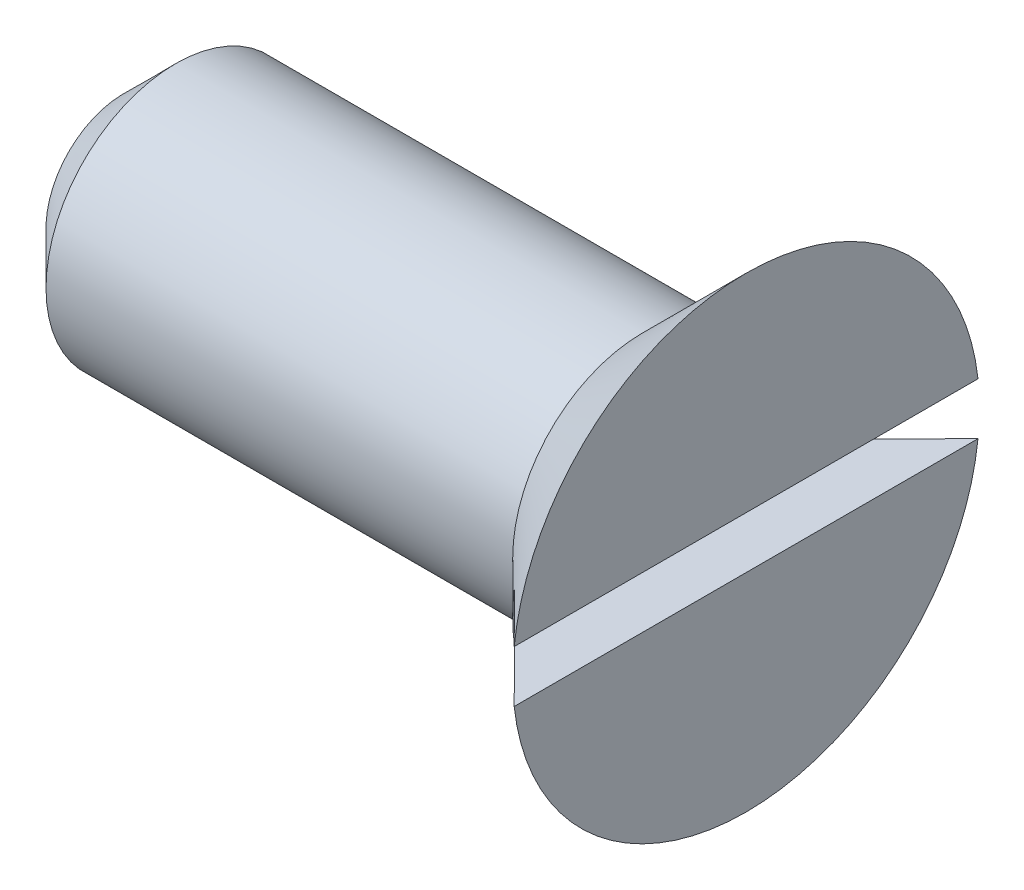
ISO-10303-21;
HEADER;
FILE_DESCRIPTION(('STEP AP214'),'2;1');
FILE_NAME('part.step','',(''),(''),'','','');
FILE_SCHEMA(('AUTOMOTIVE_DESIGN { 1 0 10303 214 1 1 1 1 }'));
ENDSEC;
DATA;
#1=APPLICATION_CONTEXT('core data for automotive mechanical design processes');
#2=APPLICATION_PROTOCOL_DEFINITION('international standard','automotive_design',2000,#1);
#3=PRODUCT_CONTEXT('',#1,'mechanical');
#4=PRODUCT('Part','Part','',(#3));
#5=PRODUCT_RELATED_PRODUCT_CATEGORY('part','',(#4));
#6=PRODUCT_DEFINITION_FORMATION('','',#4);
#7=PRODUCT_DEFINITION_CONTEXT('part definition',#1,'design');
#8=PRODUCT_DEFINITION('design','',#6,#7);
#9=PRODUCT_DEFINITION_SHAPE('','',#8);
#10=(LENGTH_UNIT() NAMED_UNIT(*) SI_UNIT(.MILLI.,.METRE.));
#11=(NAMED_UNIT(*) PLANE_ANGLE_UNIT() SI_UNIT($,.RADIAN.));
#12=(NAMED_UNIT(*) SI_UNIT($,.STERADIAN.) SOLID_ANGLE_UNIT());
#13=UNCERTAINTY_MEASURE_WITH_UNIT(LENGTH_MEASURE(1.E-05),#10,'distance_accuracy_value','');
#14=(GEOMETRIC_REPRESENTATION_CONTEXT(3) GLOBAL_UNCERTAINTY_ASSIGNED_CONTEXT((#13)) GLOBAL_UNIT_ASSIGNED_CONTEXT((#10,
#11,#12)) REPRESENTATION_CONTEXT('',''));
#15=CARTESIAN_POINT('',(0.,0.,0.));
#16=DIRECTION('',(0.,0.,1.));
#17=DIRECTION('',(1.,0.,0.));
#18=AXIS2_PLACEMENT_3D('',#15,#16,#17);
#19=CARTESIAN_POINT('',(12.,-6.38378239159465E-13,-4.5000000000012));
#20=DIRECTION('',(-1.,0.,0.));
#21=DIRECTION('',(0.,0.,1.));
#22=AXIS2_PLACEMENT_3D('',#19,#20,#21);
#23=PLANE('',#22);
#24=CARTESIAN_POINT('',(12.,-6.93889390390723E-13,-1.22124532708767E-12));
#25=DIRECTION('',(-1.,0.,0.));
#26=DIRECTION('',(0.,0.,1.));
#27=AXIS2_PLACEMENT_3D('',#24,#25,#26);
#28=CIRCLE('',#27,4.50000000000001);
#29=CARTESIAN_POINT('',(12.,0.499999999999154,4.47213595499676));
#30=VERTEX_POINT('',#29);
#31=CARTESIAN_POINT('',(12.,0.499999999999445,-4.47213595500109));
#32=VERTEX_POINT('',#31);
#33=EDGE_CURVE('E111',#30,#32,#28,.T.);
#34=ORIENTED_EDGE('',*,*,#33,.F.);
#35=DIRECTION('',(0.,0.,0.999999999999974));
#36=VECTOR('',#35,1.);
#37=CARTESIAN_POINT('',(12.,0.499999999999307,-4.82876236688612));
#38=LINE('',#37,#36);
#39=EDGE_CURVE('E106',#32,#30,#38,.T.);
#40=ORIENTED_EDGE('',*,*,#39,.F.);
#41=EDGE_LOOP('',(#34,#40));
#42=FACE_BOUND('',#41,.T.);
#43=ADVANCED_FACE('F50',(#42),#23,.F.);
#44=CARTESIAN_POINT('',(0.,0.,-2.50000000000072));
#45=DIRECTION('',(1.,0.,0.));
#46=DIRECTION('',(0.,0.,-1.));
#47=AXIS2_PLACEMENT_3D('',#44,#45,#46);
#48=PLANE('',#47);
#49=CARTESIAN_POINT('',(0.,0.,0.));
#50=DIRECTION('',(1.,0.,0.));
#51=DIRECTION('',(0.,0.,-1.));
#52=AXIS2_PLACEMENT_3D('',#49,#50,#51);
#53=CIRCLE('',#52,1.5);
#54=CARTESIAN_POINT('',(0.,0.,-1.5));
#55=VERTEX_POINT('',#54);
#56=EDGE_CURVE('E115',#55,#55,#53,.F.);
#57=ORIENTED_EDGE('',*,*,#56,.T.);
#58=EDGE_LOOP('',(#57));
#59=FACE_BOUND('',#58,.T.);
#60=ADVANCED_FACE('F150',(#59),#48,.F.);
#61=CARTESIAN_POINT('',(12.,-0.500000000000403,-4.47213595500105));
#62=VERTEX_POINT('',#61);
#63=CARTESIAN_POINT('',(12.,-0.50000000000068,4.47213595499722));
#64=VERTEX_POINT('',#63);
#65=EDGE_CURVE('E105',#62,#64,#28,.T.);
#66=ORIENTED_EDGE('',*,*,#65,.F.);
#67=DIRECTION('',(0.,0.,-0.999999999999974));
#68=VECTOR('',#67,1.);
#69=CARTESIAN_POINT('',(12.,-0.500000000000361,-4.82876236688597));
#70=LINE('',#69,#68);
#71=EDGE_CURVE('E97',#64,#62,#70,.T.);
#72=ORIENTED_EDGE('',*,*,#71,.F.);
#73=EDGE_LOOP('',(#66,#72));
#74=FACE_BOUND('',#73,.T.);
#75=ADVANCED_FACE('F104',(#74),#23,.F.);
#76=CARTESIAN_POINT('',(12.,-6.93889390390723E-13,-1.22124532708767E-12));
#77=DIRECTION('',(1.,0.,0.));
#78=DIRECTION('',(0.,0.,-1.));
#79=AXIS2_PLACEMENT_3D('',#76,#77,#78);
#80=CONICAL_SURFACE('',#79,4.50000000000001,0.78539816339745);
#81=CARTESIAN_POINT('',(11.,1.19348975147204E-12,-5.74540415243519E-12));
#82=DIRECTION('',(1.,0.,0.));
#83=DIRECTION('',(0.,0.,-1.));
#84=AXIS2_PLACEMENT_3D('',#81,#82,#83);
#85=CIRCLE('',#84,3.5);
#86=CARTESIAN_POINT('',(11.,0.500000000001374,3.4641016151314));
#87=VERTEX_POINT('',#86);
#88=CARTESIAN_POINT('',(11.,-0.499999999999001,3.46410161513135));
#89=VERTEX_POINT('',#88);
#90=EDGE_CURVE('E76',#87,#89,#85,.T.);
#91=ORIENTED_EDGE('',*,*,#90,.F.);
#92=CARTESIAN_POINT('',(17.4334310828825,0.500000000000722,-9.92083933336727));
#93=CARTESIAN_POINT('',(17.094622836699,0.500000000001105,-9.58159761233316));
#94=CARTESIAN_POINT('',(16.7558333911452,0.500000000001262,-9.24233710479051));
#95=CARTESIAN_POINT('',(16.078313934879,0.500000000001377,-8.56375204602625));
#96=CARTESIAN_POINT('',(15.7395839245957,0.500000000001335,-8.22442749437636));
#97=CARTESIAN_POINT('',(15.0621562101789,0.500000000001304,-7.54563881132056));
#98=CARTESIAN_POINT('',(14.7234585196696,0.500000000001315,-7.20617466631724));
#99=CARTESIAN_POINT('',(14.0461951542393,0.500000000001324,-6.52711926848112));
#100=CARTESIAN_POINT('',(13.7076294784402,0.500000000001321,-6.18752801652417));
#101=CARTESIAN_POINT('',(13.0230688559618,0.500000000001317,-5.50046940668222));
#102=CARTESIAN_POINT('',(12.6770786993064,0.500000000001316,-5.15299727610346));
#103=CARTESIAN_POINT('',(11.9854716695215,0.500000000001322,-4.45766761430393));
#104=CARTESIAN_POINT('',(11.6398548039808,0.500000000001329,-4.1098100755289));
#105=CARTESIAN_POINT('',(11.1220495656091,0.500000000001313,-3.58744392363228));
#106=CARTESIAN_POINT('',(10.9495599143647,0.500000000001303,-3.4132341018551));
#107=CARTESIAN_POINT('',(10.6049016321769,0.500000000001334,-3.06449437078587));
#108=CARTESIAN_POINT('',(10.4327330038494,0.500000000001374,-2.88996445890822));
#109=CARTESIAN_POINT('',(10.0889298219588,0.500000000001263,-2.54039099537063));
#110=CARTESIAN_POINT('',(9.91729524886004,0.500000000001112,-2.3653474629649));
#111=CARTESIAN_POINT('',(9.66060434588069,0.500000000001421,-2.10204221394459));
#112=CARTESIAN_POINT('',(9.57516809923935,0.500000000001614,-2.01415105527254));
#113=CARTESIAN_POINT('',(9.40467044483652,0.500000000001022,-1.83800611142218));
#114=CARTESIAN_POINT('',(9.31960903527704,0.500000000000238,-1.7497523279872));
#115=CARTESIAN_POINT('',(9.18895844071863,0.500000000000685,-1.61330986538524));
#116=CARTESIAN_POINT('',(9.14316496753373,0.500000000001156,-1.5653168931215));
#117=CARTESIAN_POINT('',(9.05179993978355,0.50000000000148,-1.46911892921733));
#118=CARTESIAN_POINT('',(9.00622838799009,0.500000000001333,-1.42091393494294));
#119=CARTESIAN_POINT('',(8.91548272610002,0.500000000001303,-1.32433574945523));
#120=CARTESIAN_POINT('',(8.87030795026539,0.50000000000142,-1.27596318514585));
#121=CARTESIAN_POINT('',(8.78036644382885,0.500000000001215,-1.17884327238731));
#122=CARTESIAN_POINT('',(8.73559970075986,0.500000000000893,-1.13009593547346));
#123=CARTESIAN_POINT('',(8.63156798542597,0.500000000000752,-1.01549018413044));
#124=CARTESIAN_POINT('',(8.57252649589879,0.500000000001141,-0.949426917330761));
#125=CARTESIAN_POINT('',(8.48517998291026,0.500000000001407,-0.849027252819726));
#126=CARTESIAN_POINT('',(8.45620834486544,0.500000000001442,-0.815271939591469));
#127=CARTESIAN_POINT('',(8.3988965778735,0.500000000001193,-0.747230628198328));
#128=CARTESIAN_POINT('',(8.37055641002422,0.50000000000091,-0.712944662946387));
#129=CARTESIAN_POINT('',(8.31453294463235,0.500000000000923,-0.6433466709596));
#130=CARTESIAN_POINT('',(8.28685743704845,0.500000000001225,-0.608028338858887));
#131=CARTESIAN_POINT('',(8.23288658906871,0.50000000000141,-0.536358792810566));
#132=CARTESIAN_POINT('',(8.20659077183528,0.500000000001292,-0.500007942498352));
#133=CARTESIAN_POINT('',(8.15629156070385,0.500000000001343,-0.425977065402346));
#134=CARTESIAN_POINT('',(8.13227821986974,0.500000000001511,-0.388303888131977));
#135=CARTESIAN_POINT('',(8.08791744878626,0.500000000001125,-0.310893832367545));
#136=CARTESIAN_POINT('',(8.06756045180613,0.500000000000573,-0.271162700484368));
#137=CARTESIAN_POINT('',(8.03752958522089,0.500000000000834,-0.199280580632974));
#138=CARTESIAN_POINT('',(8.02645653543489,0.500000000001338,-0.167736256207086));
#139=CARTESIAN_POINT('',(8.00963250807975,0.500000000001297,-0.103336815945441));
#140=CARTESIAN_POINT('',(8.00385536010017,0.500000000000757,-0.0704889918050561));
#141=CARTESIAN_POINT('',(7.99890901284613,0.50000000000077,-0.00391759075869643));
#142=CARTESIAN_POINT('',(7.99980881923559,0.500000000001334,0.0298115312882031));
#143=CARTESIAN_POINT('',(8.00813776796226,0.5000000000013,0.0965071541604435));
#144=CARTESIAN_POINT('',(8.01558887477218,0.500000000000698,0.129470706320155));
#145=CARTESIAN_POINT('',(8.03280310431992,0.500000000000788,0.185466604171374));
#146=CARTESIAN_POINT('',(8.04146820312156,0.500000000001186,0.208860616958532));
#147=CARTESIAN_POINT('',(8.06080064801388,0.500000000001449,0.254816663178605));
#148=CARTESIAN_POINT('',(8.07146948011995,0.500000000001315,0.2773780641728));
#149=CARTESIAN_POINT('',(8.09431898535568,0.50000000000132,0.321840394641634));
#150=CARTESIAN_POINT('',(8.10650643866166,0.500000000001461,0.343737776911768));
#151=CARTESIAN_POINT('',(8.1319600328398,0.500000000001174,0.386877858465585));
#152=CARTESIAN_POINT('',(8.14522573137379,0.500000000000746,0.408120821334638));
#153=CARTESIAN_POINT('',(8.19135616707382,0.500000000000103,0.478982606500176));
#154=CARTESIAN_POINT('',(8.22605662646354,0.500000000000992,0.527397940679881));
#155=CARTESIAN_POINT('',(8.29781340694147,0.500000000001643,0.622462852281961));
#156=CARTESIAN_POINT('',(8.33487192774693,0.500000000001405,0.669110714246478));
#157=CARTESIAN_POINT('',(8.41048560367556,0.500000000001229,0.761369243957627));
#158=CARTESIAN_POINT('',(8.44904426520622,0.500000000001292,0.806977030620386));
#159=CARTESIAN_POINT('',(8.52703681580845,0.500000000001342,0.897398644487044));
#160=CARTESIAN_POINT('',(8.56647033422307,0.50000000000133,0.942212793993296));
#161=CARTESIAN_POINT('',(8.64602665873576,0.500000000001304,1.03139885551162));
#162=CARTESIAN_POINT('',(8.6861507758829,0.50000000000129,1.07576959563431));
#163=CARTESIAN_POINT('',(8.76683137244409,0.500000000001345,1.16412357585452));
#164=CARTESIAN_POINT('',(8.80738789577994,0.500000000001415,1.2081067757426));
#165=CARTESIAN_POINT('',(8.92939021280496,0.500000000001122,1.33948593316749));
#166=CARTESIAN_POINT('',(9.0112969194605,0.500000000000259,1.42645342036056));
#167=CARTESIAN_POINT('',(9.17505616742924,0.500000000000213,1.59891371342962));
#168=CARTESIAN_POINT('',(9.25690220849735,0.500000000001015,1.68441271958131));
#169=CARTESIAN_POINT('',(9.42104405611289,0.500000000001619,1.8549782909493));
#170=CARTESIAN_POINT('',(9.50333986439926,0.500000000001422,1.94004485449117));
#171=CARTESIAN_POINT('',(9.75067700604964,0.500000000001106,2.19481879501315));
#172=CARTESIAN_POINT('',(9.91616244228635,0.500000000001261,2.36409455787665));
#173=CARTESIAN_POINT('',(10.2478424695637,0.500000000001372,2.70216112923317));
#174=CARTESIAN_POINT('',(10.4140374466611,0.500000000001328,2.8709515580475));
#175=CARTESIAN_POINT('',(10.7467865073139,0.500000000001305,3.20817270388613));
#176=CARTESIAN_POINT('',(10.9133405850914,0.500000000001327,3.37660342661256));
#177=CARTESIAN_POINT('',(11.2461450940172,0.500000000001307,3.71270085678454));
#178=CARTESIAN_POINT('',(11.412394796293,0.500000000001265,3.88036828639177));
#179=CARTESIAN_POINT('',(11.7450495611567,0.500000000001367,4.21555034245018));
#180=CARTESIAN_POINT('',(11.9114546243984,0.500000000001511,4.38306496825236));
#181=CARTESIAN_POINT('',(12.4107648936833,0.500000000000927,4.88538300082148));
#182=CARTESIAN_POINT('',(12.7438307481285,0.499999999999188,5.22002669562224));
#183=CARTESIAN_POINT('',(13.4391444176929,0.499999999998914,5.91814806333324));
#184=CARTESIAN_POINT('',(13.8014133442417,0.500000000000672,6.28160470104474));
#185=CARTESIAN_POINT('',(14.526139541999,0.50000000000196,7.00837896847507));
#186=CARTESIAN_POINT('',(14.8885968242511,0.500000000001489,7.37169658718066));
#187=CARTESIAN_POINT('',(15.6147555520468,0.500000000001141,8.09937108507071));
#188=CARTESIAN_POINT('',(15.9784573244717,0.500000000001265,8.4637276380171));
#189=CARTESIAN_POINT('',(16.7059094181798,0.500000000001365,9.19234290705398));
#190=CARTESIAN_POINT('',(17.0696597344934,0.500000000001342,9.55660162810588));
#191=CARTESIAN_POINT('',(17.4334310828838,0.500000000000875,9.92083933335545));
#192=B_SPLINE_CURVE_WITH_KNOTS('',3,(#92,#93,#94,#95,#96,#97,#98,#99,#100,#101,#102,#103,#104,
#105,#106,#107,#108,#109,#110,#111,#112,#113,#114,#115,#116,#117,#118,#119,#120,#121,#122,#123,
#124,#125,#126,#127,#128,#129,#130,#131,#132,#133,#134,#135,#136,#137,#138,#139,#140,#141,#142,
#143,#144,#145,#146,#147,#148,#149,#150,#151,#152,#153,#154,#155,#156,#157,#158,#159,#160,#161,
#162,#163,#164,#165,#166,#167,#168,#169,#170,#171,#172,#173,#174,#175,#176,#177,#178,#179,#180,
#181,#182,#183,#184,#185,#186,#187,#188,#189,#190,#191),.UNSPECIFIED.,.F.,.F.,(4,2,2,2,2,2,2,2,
2,2,2,2,2,2,2,2,2,2,2,2,2,2,2,2,2,2,2,2,2,2,2,2,2,2,2,2,2,2,2,2,2,2,2,2,2,2,2,2,2,4),(0.,
1.43836149369475,2.87673297314253,4.31533237234154,5.75392203488066,7.22498096900311,
8.69606926591532,9.43153865323218,10.1670140078269,10.9024621349981,11.2701813429453,
11.6378987851402,11.8369040385567,12.0359117712339,12.2344694542119,12.4330210499636,
12.6988031931186,12.8322483695515,12.965685302143,13.1002750154363,13.2348179022873,
13.3687446332908,13.502315674941,13.6022937476715,13.7017750593242,13.8022859217004,
13.9031350562239,13.977874330053,14.0526692527251,14.1278109554241,14.202921986168,
14.3814550436051,14.5601571590546,14.7393055443459,14.9183794257286,15.0978422373122,
15.2773234549228,15.6357121558031,15.9907874462848,16.345864110577,17.0560417926032,
17.7666739605456,18.4772947785412,19.1856462514791,19.8940007191524,21.3104302706779,
22.8499286738185,24.3895307818776,25.9339763327701,27.4783170755748),.UNSPECIFIED.);
#193=EDGE_CURVE('E13',#87,#30,#192,.T.);
#194=ORIENTED_EDGE('',*,*,#193,.T.);
#195=ORIENTED_EDGE('',*,*,#33,.T.);
#196=CARTESIAN_POINT('',(11.,0.500000000001222,-3.46410161514364));
#197=VERTEX_POINT('',#196);
#198=EDGE_CURVE('E54',#32,#197,#192,.T.);
#199=ORIENTED_EDGE('',*,*,#198,.T.);
#200=CARTESIAN_POINT('',(11.,-0.499999999998973,-3.46410161514328));
#201=VERTEX_POINT('',#200);
#202=EDGE_CURVE('E126',#201,#197,#85,.T.);
#203=ORIENTED_EDGE('',*,*,#202,.F.);
#204=CARTESIAN_POINT('',(17.4334310828852,-0.499999999999112,9.92083933335497));
#205=CARTESIAN_POINT('',(17.0946228366973,-0.499999999998884,9.58159761232457));
#206=CARTESIAN_POINT('',(16.7558333911414,-0.49999999999879,9.24233710478321));
#207=CARTESIAN_POINT('',(16.0783139348732,-0.499999999998721,8.56375204601941));
#208=CARTESIAN_POINT('',(15.7395839245899,-0.499999999998746,8.22442749436869));
#209=CARTESIAN_POINT('',(15.0621562101727,-0.499999999998764,7.54563881131184));
#210=CARTESIAN_POINT('',(14.7234585196629,-0.499999999998757,7.2061746663083));
#211=CARTESIAN_POINT('',(14.0461951542318,-0.499999999998752,6.52711926847161));
#212=CARTESIAN_POINT('',(13.7076294784325,-0.499999999998753,6.18752801651429));
#213=CARTESIAN_POINT('',(13.0230688559536,-0.499999999998756,5.50046940667194));
#214=CARTESIAN_POINT('',(12.6770786992982,-0.499999999998757,5.15299727609313));
#215=CARTESIAN_POINT('',(11.9854716695132,-0.499999999998751,4.45766761429352));
#216=CARTESIAN_POINT('',(11.6398548039723,-0.499999999998745,4.10981007551844));
#217=CARTESIAN_POINT('',(11.1220495656005,-0.499999999998758,3.58744392362172));
#218=CARTESIAN_POINT('',(10.9495599143561,-0.499999999998766,3.4132341018445));
#219=CARTESIAN_POINT('',(10.6049016321681,-0.499999999998741,3.06449437077519));
#220=CARTESIAN_POINT('',(10.4327330038406,-0.499999999998707,2.88996445889752));
#221=CARTESIAN_POINT('',(10.0889298219498,-0.4999999999988,2.54039099535981));
#222=CARTESIAN_POINT('',(9.91729524885107,-0.499999999998927,2.36534746295399));
#223=CARTESIAN_POINT('',(9.6606043458715,-0.499999999998667,2.10204221393371));
#224=CARTESIAN_POINT('',(9.57516809923005,-0.499999999998505,2.01415105526171));
#225=CARTESIAN_POINT('',(9.40467044482735,-0.499999999999002,1.83800611141111));
#226=CARTESIAN_POINT('',(9.31960903526813,-0.499999999999661,1.74975232797583));
#227=CARTESIAN_POINT('',(9.18895844071013,-0.499999999999286,1.6133098653747));
#228=CARTESIAN_POINT('',(9.1431649675257,-0.49999999999889,1.56531689311183));
#229=CARTESIAN_POINT('',(9.05179993977676,-0.499999999998617,1.46911892920911));
#230=CARTESIAN_POINT('',(9.00622838798407,-0.499999999998739,1.42091393493531));
#231=CARTESIAN_POINT('',(8.91548272609509,-0.499999999998767,1.3243357494492));
#232=CARTESIAN_POINT('',(8.87030795026078,-0.499999999998673,1.27596318514082));
#233=CARTESIAN_POINT('',(8.78036644382629,-0.499999999998834,1.17884327238294));
#234=CARTESIAN_POINT('',(8.73559970075905,-0.499999999999089,1.13009593546875));
#235=CARTESIAN_POINT('',(8.63156798542628,-0.499999999999209,1.01549018412609));
#236=CARTESIAN_POINT('',(8.57252649589775,-0.499999999998912,0.949426917327777));
#237=CARTESIAN_POINT('',(8.48517998290814,-0.499999999998673,0.849027252817873));
#238=CARTESIAN_POINT('',(8.45620834486312,-0.499999999998628,0.815271939589846));
#239=CARTESIAN_POINT('',(8.39889657787228,-0.499999999998878,0.747230628195918));
#240=CARTESIAN_POINT('',(8.3705564100243,-0.499999999999172,0.712944662942959));
#241=CARTESIAN_POINT('',(8.31453294463225,-0.499999999999164,0.643346670956281));
#242=CARTESIAN_POINT('',(8.28685743704685,-0.499999999998856,0.608028338856711));
#243=CARTESIAN_POINT('',(8.23288658906609,-0.49999999999865,0.536358792809157));
#244=CARTESIAN_POINT('',(8.20659077183315,-0.499999999998753,0.500007942496565));
#245=CARTESIAN_POINT('',(8.15629156070123,-0.499999999998753,0.425977065400788));
#246=CARTESIAN_POINT('',(8.13227821986614,-0.499999999998651,0.388303888131028));
#247=CARTESIAN_POINT('',(8.08791744878457,-0.499999999998855,0.310893832365695));
#248=CARTESIAN_POINT('',(8.06756045180735,-0.49999999999916,0.271162700480993));
#249=CARTESIAN_POINT('',(8.03752958522003,-0.499999999999004,0.199280580629551));
#250=CARTESIAN_POINT('',(8.02645653543084,-0.499999999998716,0.167736256204517));
#251=CARTESIAN_POINT('',(8.00963250807616,-0.49999999999879,0.103336815943072));
#252=CARTESIAN_POINT('',(8.00385536010019,-0.499999999999149,0.0704889918020385));
#253=CARTESIAN_POINT('',(7.99890901284611,-0.499999999999131,0.00391759075484003));
#254=CARTESIAN_POINT('',(7.99980881923184,-0.499999999998746,-0.0298115312922451));
#255=CARTESIAN_POINT('',(8.00813776795851,-0.499999999998759,-0.0965071541640469));
#256=CARTESIAN_POINT('',(8.01558887477219,-0.499999999999161,-0.129470706323132));
#257=CARTESIAN_POINT('',(8.03280310431993,-0.499999999999101,-0.185466604174954));
#258=CARTESIAN_POINT('',(8.04146820311953,-0.499999999998836,-0.208860616962923));
#259=CARTESIAN_POINT('',(8.06080064801057,-0.499999999998669,-0.25481666318346));
#260=CARTESIAN_POINT('',(8.07146948011738,-0.499999999998768,-0.277378064177315));
#261=CARTESIAN_POINT('',(8.09431898535349,-0.499999999998738,-0.321840394645944));
#262=CARTESIAN_POINT('',(8.10650643865911,-0.499999999998608,-0.343737776916214));
#263=CARTESIAN_POINT('',(8.13196003283805,-0.499999999998897,-0.386877858469546));
#264=CARTESIAN_POINT('',(8.14522573137321,-0.499999999999315,-0.408120821337975));
#265=CARTESIAN_POINT('',(8.19135616707551,-0.499999999999942,-0.478982606503094));
#266=CARTESIAN_POINT('',(8.22605662646368,-0.499999999999072,-0.527397940684685));
#267=CARTESIAN_POINT('',(8.29781340694112,-0.499999999998433,-0.62246285228864));
#268=CARTESIAN_POINT('',(8.33487192774763,-0.499999999998667,-0.669110714253147));
#269=CARTESIAN_POINT('',(8.41048560367748,-0.499999999998839,-0.761369243964572));
#270=CARTESIAN_POINT('',(8.44904426520831,-0.499999999998777,-0.806977030627621));
#271=CARTESIAN_POINT('',(8.52703681581108,-0.499999999998728,-0.897398644494798));
#272=CARTESIAN_POINT('',(8.56647033422608,-0.499999999998743,-0.942212794001278));
#273=CARTESIAN_POINT('',(8.64602665873952,-0.499999999998762,-1.03139885552012));
#274=CARTESIAN_POINT('',(8.68615077588704,-0.499999999998768,-1.0757695956431));
#275=CARTESIAN_POINT('',(8.7668313724489,-0.499999999998736,-1.16412357586395));
#276=CARTESIAN_POINT('',(8.80738789578503,-0.499999999998698,-1.20810677575238));
#277=CARTESIAN_POINT('',(8.92939021281153,-0.49999999999886,-1.33948593317805));
#278=CARTESIAN_POINT('',(9.01129691946871,-0.499999999999336,-1.42645342037112));
#279=CARTESIAN_POINT('',(9.17505616743844,-0.499999999999361,-1.59891371344089));
#280=CARTESIAN_POINT('',(9.2569022085059,-0.499999999998919,-1.68441271959328));
#281=CARTESIAN_POINT('',(9.42104405612105,-0.499999999998586,-1.85497829096181));
#282=CARTESIAN_POINT('',(9.50333986440767,-0.499999999998694,-1.94004485450352));
#283=CARTESIAN_POINT('',(9.75067700605855,-0.499999999998868,-2.19481879502524));
#284=CARTESIAN_POINT('',(9.91616244229524,-0.499999999998783,-2.3640945578889));
#285=CARTESIAN_POINT('',(10.2478424695726,-0.499999999998722,-2.70216112924546));
#286=CARTESIAN_POINT('',(10.41403744667,-0.499999999998746,-2.87095155805967));
#287=CARTESIAN_POINT('',(10.7467865073228,-0.499999999998758,-3.20817270389813));
#288=CARTESIAN_POINT('',(10.9133405851002,-0.499999999998744,-3.37660342662451));
#289=CARTESIAN_POINT('',(11.246145094026,-0.499999999998759,-3.7127008567964));
#290=CARTESIAN_POINT('',(11.4123947963018,-0.499999999998788,-3.8803682864036));
#291=CARTESIAN_POINT('',(11.7450495611655,-0.499999999998715,-4.21555034246197));
#292=CARTESIAN_POINT('',(11.9114546244072,-0.499999999998613,-4.38306496826412));
#293=CARTESIAN_POINT('',(12.4107648936922,-0.499999999999029,-4.88538300083323));
#294=CARTESIAN_POINT('',(12.7438307481375,-0.500000000000269,-5.22002669563397));
#295=CARTESIAN_POINT('',(13.4391444177016,-0.500000000000462,-5.91814806334457));
#296=CARTESIAN_POINT('',(13.80141334425,-0.499999999999207,-6.2816047010557));
#297=CARTESIAN_POINT('',(14.5261395420063,-0.499999999998294,-7.0083789684853));
#298=CARTESIAN_POINT('',(14.888596824258,-0.499999999998636,-7.37169658719054));
#299=CARTESIAN_POINT('',(15.6147555520531,-0.499999999998866,-8.09937108507948));
#300=CARTESIAN_POINT('',(15.978457324478,-0.499999999998752,-8.46372763802512));
#301=CARTESIAN_POINT('',(16.7059094181844,-0.499999999998748,-9.19234290706213));
#302=CARTESIAN_POINT('',(17.0696597344963,-0.499999999998857,-9.55660162811493));
#303=CARTESIAN_POINT('',(17.4334310828832,-0.499999999999418,-9.92083933336722));
#304=B_SPLINE_CURVE_WITH_KNOTS('',3,(#204,#205,#206,#207,#208,#209,#210,#211,#212,#213,#214,
#215,#216,#217,#218,#219,#220,#221,#222,#223,#224,#225,#226,#227,#228,#229,#230,#231,#232,#233,
#234,#235,#236,#237,#238,#239,#240,#241,#242,#243,#244,#245,#246,#247,#248,#249,#250,#251,#252,
#253,#254,#255,#256,#257,#258,#259,#260,#261,#262,#263,#264,#265,#266,#267,#268,#269,#270,#271,
#272,#273,#274,#275,#276,#277,#278,#279,#280,#281,#282,#283,#284,#285,#286,#287,#288,#289,#290,
#291,#292,#293,#294,#295,#296,#297,#298,#299,#300,#301,#302,#303),.UNSPECIFIED.,.F.,.F.,(4,2,2,
2,2,2,2,2,2,2,2,2,2,2,2,2,2,2,2,2,2,2,2,2,2,2,2,2,2,2,2,2,2,2,2,2,2,2,2,2,2,2,2,2,2,2,2,2,2,4),
(0.,1.43836149369641,2.87673297314585,4.31533237234629,5.75392203488684,7.22498096900955,
8.69606926592201,9.4315386532391,10.167014007834,10.9024621350055,11.2701813429528,
11.6378987851478,11.8369040385615,12.0359117712358,12.234469454211,12.4330210499599,
12.6988031931146,12.8322483695473,12.9656853021387,13.1002750154321,13.2348179022832,
13.3687446332864,13.5023156749374,13.6022937476683,13.7017750593213,13.8022859216978,
13.9031350562215,13.977874330051,14.052669252723,14.1278109554219,14.202921986166,
14.3814550436053,14.5601571590566,14.7393055443489,14.9183794257328,15.0978422373178,
15.2773234549298,15.6357121558135,15.9907874462954,16.3458641105878,17.0560417926143,
17.7666739605565,18.4772947785519,19.1856462514897,19.894000719163,21.3104302706887,
22.8499286738276,24.3895307818849,25.9339763327756,27.4783170755787),.UNSPECIFIED.);
#305=EDGE_CURVE('E101',#201,#62,#304,.T.);
#306=ORIENTED_EDGE('',*,*,#305,.T.);
#307=ORIENTED_EDGE('',*,*,#65,.T.);
#308=EDGE_CURVE('E64',#64,#89,#304,.T.);
#309=ORIENTED_EDGE('',*,*,#308,.T.);
#310=EDGE_LOOP('',(#91,#194,#195,#199,#203,#306,#307,#309));
#311=FACE_BOUND('',#310,.T.);
#312=CARTESIAN_POINT('',(10.,1.11022302462516E-13,-5.82867087928207E-13));
#313=DIRECTION('',(-1.,0.,0.));
#314=DIRECTION('',(0.,0.,1.));
#315=AXIS2_PLACEMENT_3D('',#312,#313,#314);
#316=CIRCLE('',#315,2.5);
#317=CARTESIAN_POINT('',(10.,1.11022302462516E-13,2.49999999999942));
#318=VERTEX_POINT('',#317);
#319=EDGE_CURVE('E112',#318,#318,#316,.T.);
#320=ORIENTED_EDGE('',*,*,#319,.F.);
#321=EDGE_LOOP('',(#320));
#322=FACE_BOUND('',#321,.T.);
#323=ADVANCED_FACE('F108',(#311,#322),#80,.T.);
#324=CARTESIAN_POINT('',(0.,0.,0.));
#325=DIRECTION('',(-1.,0.,0.));
#326=DIRECTION('',(0.,0.,1.));
#327=AXIS2_PLACEMENT_3D('',#324,#325,#326);
#328=CYLINDRICAL_SURFACE('',#327,2.5);
#329=CARTESIAN_POINT('',(1.,6.66133814775094E-13,-5.5649929109336E-12));
#330=DIRECTION('',(1.,0.,0.));
#331=DIRECTION('',(0.,0.,-1.));
#332=AXIS2_PLACEMENT_3D('',#329,#330,#331);
#333=CIRCLE('',#332,2.5);
#334=CARTESIAN_POINT('',(1.,6.66133814775094E-13,-2.50000000000556));
#335=VERTEX_POINT('',#334);
#336=EDGE_CURVE('E123',#335,#335,#333,.T.);
#337=ORIENTED_EDGE('',*,*,#336,.T.);
#338=EDGE_LOOP('',(#337));
#339=FACE_BOUND('',#338,.T.);
#340=ORIENTED_EDGE('',*,*,#319,.T.);
#341=EDGE_LOOP('',(#340));
#342=FACE_BOUND('',#341,.T.);
#343=ADVANCED_FACE('F140',(#339,#342),#328,.T.);
#344=CARTESIAN_POINT('',(0.,0.,0.));
#345=DIRECTION('',(1.,0.,0.));
#346=DIRECTION('',(0.,0.,-1.));
#347=AXIS2_PLACEMENT_3D('',#344,#345,#346);
#348=CONICAL_SURFACE('',#347,1.5,0.785398163397447);
#349=ORIENTED_EDGE('',*,*,#336,.F.);
#350=EDGE_LOOP('',(#349));
#351=FACE_BOUND('',#350,.T.);
#352=ORIENTED_EDGE('',*,*,#56,.F.);
#353=EDGE_LOOP('',(#352));
#354=FACE_BOUND('',#353,.T.);
#355=ADVANCED_FACE('F52',(#351,#354),#348,.T.);
#356=CARTESIAN_POINT('',(11.,0.500000000001319,-4.82876236688952));
#357=DIRECTION('',(0.,0.999999999999974,0.));
#358=DIRECTION('',(0.,0.,0.999999999999974));
#359=AXIS2_PLACEMENT_3D('',#356,#357,#358);
#360=PLANE('',#359);
#361=ORIENTED_EDGE('',*,*,#39,.T.);
#362=ORIENTED_EDGE('',*,*,#193,.F.);
#363=DIRECTION('',(0.,0.,0.999999999999974));
#364=VECTOR('',#363,1.);
#365=CARTESIAN_POINT('',(11.,0.500000000001319,-4.82876236688952));
#366=LINE('',#365,#364);
#367=EDGE_CURVE('E117',#197,#87,#366,.T.);
#368=ORIENTED_EDGE('',*,*,#367,.F.);
#369=ORIENTED_EDGE('',*,*,#198,.F.);
#370=EDGE_LOOP('',(#361,#362,#368,#369));
#371=FACE_BOUND('',#370,.T.);
#372=ADVANCED_FACE('F137',(#371),#360,.F.);
#373=CARTESIAN_POINT('',(11.,-0.499999999998751,-4.82876236688981));
#374=DIRECTION('',(0.,-0.999999999999974,0.));
#375=DIRECTION('',(0.,0.,-0.999999999999974));
#376=AXIS2_PLACEMENT_3D('',#373,#374,#375);
#377=PLANE('',#376);
#378=ORIENTED_EDGE('',*,*,#71,.T.);
#379=ORIENTED_EDGE('',*,*,#305,.F.);
#380=DIRECTION('',(0.,0.,-0.999999999999974));
#381=VECTOR('',#380,1.);
#382=CARTESIAN_POINT('',(11.,-0.499999999998751,-4.82876236688981));
#383=LINE('',#382,#381);
#384=EDGE_CURVE('E71',#89,#201,#383,.T.);
#385=ORIENTED_EDGE('',*,*,#384,.F.);
#386=ORIENTED_EDGE('',*,*,#308,.F.);
#387=EDGE_LOOP('',(#378,#379,#385,#386));
#388=FACE_BOUND('',#387,.T.);
#389=ADVANCED_FACE('F96',(#388),#377,.F.);
#390=CARTESIAN_POINT('',(11.,1.19348975147204E-12,-5.74540415243519E-12));
#391=DIRECTION('',(1.,0.,0.));
#392=DIRECTION('',(0.,0.,-1.));
#393=AXIS2_PLACEMENT_3D('',#390,#391,#392);
#394=PLANE('',#393);
#395=ORIENTED_EDGE('',*,*,#90,.T.);
#396=ORIENTED_EDGE('',*,*,#384,.T.);
#397=ORIENTED_EDGE('',*,*,#202,.T.);
#398=ORIENTED_EDGE('',*,*,#367,.T.);
#399=EDGE_LOOP('',(#395,#396,#397,#398));
#400=FACE_BOUND('',#399,.T.);
#401=ADVANCED_FACE('F136',(#400),#394,.T.);
#402=CLOSED_SHELL('',(#43,#60,#75,#323,#343,#355,#372,#389,#401));
#403=MANIFOLD_SOLID_BREP('B2',#402);
#404=ADVANCED_BREP_SHAPE_REPRESENTATION('',(#18,#403),#14);
#405=SHAPE_DEFINITION_REPRESENTATION(#9,#404);
ENDSEC;
END-ISO-10303-21;
